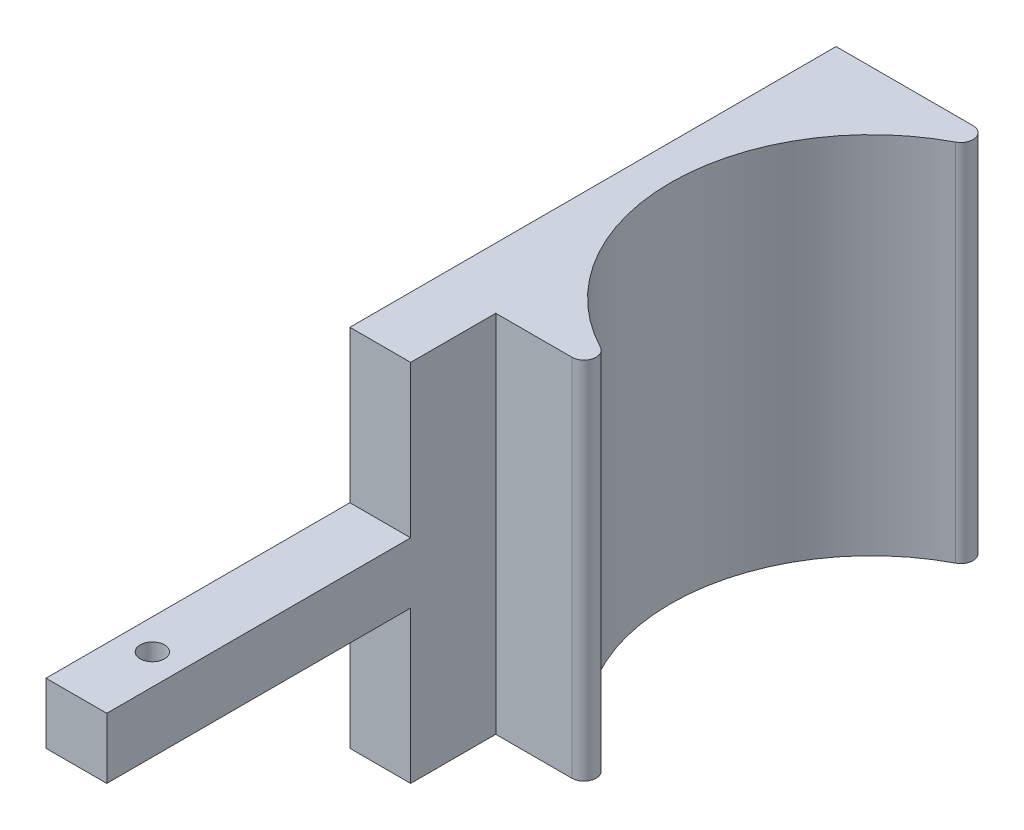
ISO-10303-21;
HEADER;
FILE_DESCRIPTION(('STEP AP214'),'2;1');
FILE_NAME('part.step','',(''),(''),'','','');
FILE_SCHEMA(('AUTOMOTIVE_DESIGN { 1 0 10303 214 1 1 1 1 }'));
ENDSEC;
DATA;
#1=APPLICATION_CONTEXT('core data for automotive mechanical design processes');
#2=APPLICATION_PROTOCOL_DEFINITION('international standard','automotive_design',2000,#1);
#3=PRODUCT_CONTEXT('',#1,'mechanical');
#4=PRODUCT('Part','Part','',(#3));
#5=PRODUCT_RELATED_PRODUCT_CATEGORY('part','',(#4));
#6=PRODUCT_DEFINITION_FORMATION('','',#4);
#7=PRODUCT_DEFINITION_CONTEXT('part definition',#1,'design');
#8=PRODUCT_DEFINITION('design','',#6,#7);
#9=PRODUCT_DEFINITION_SHAPE('','',#8);
#10=(LENGTH_UNIT() NAMED_UNIT(*) SI_UNIT(.MILLI.,.METRE.));
#11=(NAMED_UNIT(*) PLANE_ANGLE_UNIT() SI_UNIT($,.RADIAN.));
#12=(NAMED_UNIT(*) SI_UNIT($,.STERADIAN.) SOLID_ANGLE_UNIT());
#13=UNCERTAINTY_MEASURE_WITH_UNIT(LENGTH_MEASURE(1.E-05),#10,'distance_accuracy_value','');
#14=(GEOMETRIC_REPRESENTATION_CONTEXT(3) GLOBAL_UNCERTAINTY_ASSIGNED_CONTEXT((#13)) GLOBAL_UNIT_ASSIGNED_CONTEXT((#10,
#11,#12)) REPRESENTATION_CONTEXT('',''));
#15=CARTESIAN_POINT('',(0.,0.,0.));
#16=DIRECTION('',(0.,0.,1.));
#17=DIRECTION('',(1.,0.,0.));
#18=AXIS2_PLACEMENT_3D('',#15,#16,#17);
#19=CARTESIAN_POINT('',(-14.2717559119671,60.,77.9746603263434));
#20=DIRECTION('',(0.,0.,-1.));
#21=DIRECTION('',(-1.,0.,0.));
#22=AXIS2_PLACEMENT_3D('',#19,#20,#21);
#23=PLANE('',#22);
#24=DIRECTION('',(-1.,0.,0.));
#25=VECTOR('',#24,1.);
#26=CARTESIAN_POINT('',(-14.2717559119671,25.,77.9746603263434));
#27=LINE('',#26,#25);
#28=CARTESIAN_POINT('',(-4.27175591196712,25.,77.9746603263434));
#29=VERTEX_POINT('',#28);
#30=CARTESIAN_POINT('',(-14.2717559119671,25.,77.9746603263434));
#31=VERTEX_POINT('',#30);
#32=EDGE_CURVE('E148',#29,#31,#27,.T.);
#33=ORIENTED_EDGE('',*,*,#32,.F.);
#34=DIRECTION('',(0.,-1.,0.));
#35=VECTOR('',#34,1.);
#36=CARTESIAN_POINT('',(-4.27175591196712,60.,77.9746603263434));
#37=LINE('',#36,#35);
#38=CARTESIAN_POINT('',(-4.27175591196712,35.,77.9746603263434));
#39=VERTEX_POINT('',#38);
#40=EDGE_CURVE('E229',#39,#29,#37,.T.);
#41=ORIENTED_EDGE('',*,*,#40,.F.);
#42=DIRECTION('',(1.,0.,0.));
#43=VECTOR('',#42,1.);
#44=CARTESIAN_POINT('',(-14.2717559119671,35.,77.9746603263434));
#45=LINE('',#44,#43);
#46=CARTESIAN_POINT('',(-14.2717559119671,35.,77.9746603263434));
#47=VERTEX_POINT('',#46);
#48=EDGE_CURVE('E172',#47,#39,#45,.T.);
#49=ORIENTED_EDGE('',*,*,#48,.F.);
#50=DIRECTION('',(0.,-1.,0.));
#51=VECTOR('',#50,1.);
#52=CARTESIAN_POINT('',(-14.2717559119671,60.,77.9746603263434));
#53=LINE('',#52,#51);
#54=EDGE_CURVE('E233',#47,#31,#53,.T.);
#55=ORIENTED_EDGE('',*,*,#54,.T.);
#56=EDGE_LOOP('',(#33,#41,#49,#55));
#57=FACE_BOUND('',#56,.T.);
#58=ADVANCED_FACE('F38',(#57),#23,.F.);
#59=CARTESIAN_POINT('',(-14.2717559119671,60.,-52.0253396736566));
#60=DIRECTION('',(1.,0.,0.));
#61=DIRECTION('',(0.,0.,-1.));
#62=AXIS2_PLACEMENT_3D('',#59,#60,#61);
#63=PLANE('',#62);
#64=DIRECTION('',(0.,0.,1.));
#65=VECTOR('',#64,1.);
#66=CARTESIAN_POINT('',(-14.2717559119671,0.,-52.0253396736566));
#67=LINE('',#66,#65);
#68=CARTESIAN_POINT('',(-14.2717559119671,0.,-52.0253396736566));
#69=VERTEX_POINT('',#68);
#70=CARTESIAN_POINT('',(-14.2717559119671,0.,27.9746603263434));
#71=VERTEX_POINT('',#70);
#72=EDGE_CURVE('E159',#69,#71,#67,.T.);
#73=ORIENTED_EDGE('',*,*,#72,.T.);
#74=DIRECTION('',(0.,-1.,0.));
#75=VECTOR('',#74,1.);
#76=CARTESIAN_POINT('',(-14.2717559119671,25.,27.9746603263434));
#77=LINE('',#76,#75);
#78=CARTESIAN_POINT('',(-14.2717559119671,25.,27.9746603263434));
#79=VERTEX_POINT('',#78);
#80=EDGE_CURVE('E135',#79,#71,#77,.T.);
#81=ORIENTED_EDGE('',*,*,#80,.F.);
#82=DIRECTION('',(0.,0.,-1.));
#83=VECTOR('',#82,1.);
#84=CARTESIAN_POINT('',(-14.2717559119671,25.,77.9746603263434));
#85=LINE('',#84,#83);
#86=EDGE_CURVE('E143',#31,#79,#85,.T.);
#87=ORIENTED_EDGE('',*,*,#86,.F.);
#88=ORIENTED_EDGE('',*,*,#54,.F.);
#89=DIRECTION('',(0.,0.,1.));
#90=VECTOR('',#89,1.);
#91=CARTESIAN_POINT('',(-14.2717559119671,35.,77.9746603263434));
#92=LINE('',#91,#90);
#93=CARTESIAN_POINT('',(-14.2717559119671,35.,27.9746603263434));
#94=VERTEX_POINT('',#93);
#95=EDGE_CURVE('E169',#94,#47,#92,.T.);
#96=ORIENTED_EDGE('',*,*,#95,.F.);
#97=DIRECTION('',(0.,1.,0.));
#98=VECTOR('',#97,1.);
#99=CARTESIAN_POINT('',(-14.2717559119671,35.,27.9746603263434));
#100=LINE('',#99,#98);
#101=CARTESIAN_POINT('',(-14.2717559119671,60.,27.9746603263434));
#102=VERTEX_POINT('',#101);
#103=EDGE_CURVE('E185',#94,#102,#100,.T.);
#104=ORIENTED_EDGE('',*,*,#103,.T.);
#105=DIRECTION('',(0.,0.,1.));
#106=VECTOR('',#105,1.);
#107=CARTESIAN_POINT('',(-14.2717559119671,60.,-52.0253396736566));
#108=LINE('',#107,#106);
#109=CARTESIAN_POINT('',(-14.2717559119671,60.,-52.0253396736566));
#110=VERTEX_POINT('',#109);
#111=EDGE_CURVE('E191',#110,#102,#108,.T.);
#112=ORIENTED_EDGE('',*,*,#111,.F.);
#113=DIRECTION('',(0.,-1.,0.));
#114=VECTOR('',#113,1.);
#115=CARTESIAN_POINT('',(-14.2717559119671,60.,-52.0253396736566));
#116=LINE('',#115,#114);
#117=EDGE_CURVE('E208',#110,#69,#116,.T.);
#118=ORIENTED_EDGE('',*,*,#117,.T.);
#119=EDGE_LOOP('',(#73,#81,#87,#88,#96,#104,#112,#118));
#120=FACE_BOUND('',#119,.T.);
#121=ADVANCED_FACE('F156',(#120),#63,.F.);
#122=CARTESIAN_POINT('',(-4.27175591196712,60.,13.9746603263434));
#123=DIRECTION('',(-1.,0.,0.));
#124=DIRECTION('',(0.,0.,1.));
#125=AXIS2_PLACEMENT_3D('',#122,#123,#124);
#126=PLANE('',#125);
#127=DIRECTION('',(0.,0.,1.));
#128=VECTOR('',#127,1.);
#129=CARTESIAN_POINT('',(-4.27175591196712,25.,77.9746603263434));
#130=LINE('',#129,#128);
#131=CARTESIAN_POINT('',(-4.27175591196712,25.,27.9746603263434));
#132=VERTEX_POINT('',#131);
#133=EDGE_CURVE('E142',#132,#29,#130,.T.);
#134=ORIENTED_EDGE('',*,*,#133,.F.);
#135=DIRECTION('',(0.,-1.,0.));
#136=VECTOR('',#135,1.);
#137=CARTESIAN_POINT('',(-4.27175591196712,25.,27.9746603263434));
#138=LINE('',#137,#136);
#139=CARTESIAN_POINT('',(-4.27175591196712,0.,27.9746603263434));
#140=VERTEX_POINT('',#139);
#141=EDGE_CURVE('E138',#132,#140,#138,.T.);
#142=ORIENTED_EDGE('',*,*,#141,.T.);
#143=DIRECTION('',(0.,0.,-1.));
#144=VECTOR('',#143,1.);
#145=CARTESIAN_POINT('',(-4.27175591196712,0.,13.9746603263434));
#146=LINE('',#145,#144);
#147=CARTESIAN_POINT('',(-4.27175591196712,0.,13.9746603263434));
#148=VERTEX_POINT('',#147);
#149=EDGE_CURVE('E211',#140,#148,#146,.T.);
#150=ORIENTED_EDGE('',*,*,#149,.T.);
#151=DIRECTION('',(0.,-1.,0.));
#152=VECTOR('',#151,1.);
#153=CARTESIAN_POINT('',(-4.27175591196712,60.,13.9746603263434));
#154=LINE('',#153,#152);
#155=CARTESIAN_POINT('',(-4.27175591196712,60.,13.9746603263434));
#156=VERTEX_POINT('',#155);
#157=EDGE_CURVE('E225',#156,#148,#154,.T.);
#158=ORIENTED_EDGE('',*,*,#157,.F.);
#159=DIRECTION('',(0.,0.,-1.));
#160=VECTOR('',#159,1.);
#161=CARTESIAN_POINT('',(-4.27175591196712,60.,13.9746603263434));
#162=LINE('',#161,#160);
#163=CARTESIAN_POINT('',(-4.27175591196712,60.,27.9746603263434));
#164=VERTEX_POINT('',#163);
#165=EDGE_CURVE('E195',#164,#156,#162,.T.);
#166=ORIENTED_EDGE('',*,*,#165,.F.);
#167=DIRECTION('',(0.,1.,0.));
#168=VECTOR('',#167,1.);
#169=CARTESIAN_POINT('',(-4.27175591196712,35.,27.9746603263434));
#170=LINE('',#169,#168);
#171=CARTESIAN_POINT('',(-4.27175591196712,35.,27.9746603263434));
#172=VERTEX_POINT('',#171);
#173=EDGE_CURVE('E182',#172,#164,#170,.T.);
#174=ORIENTED_EDGE('',*,*,#173,.F.);
#175=DIRECTION('',(0.,0.,-1.));
#176=VECTOR('',#175,1.);
#177=CARTESIAN_POINT('',(-4.27175591196712,35.,77.9746603263434));
#178=LINE('',#177,#176);
#179=EDGE_CURVE('E175',#39,#172,#178,.T.);
#180=ORIENTED_EDGE('',*,*,#179,.F.);
#181=ORIENTED_EDGE('',*,*,#40,.T.);
#182=EDGE_LOOP('',(#134,#142,#150,#158,#166,#174,#180,#181));
#183=FACE_BOUND('',#182,.T.);
#184=ADVANCED_FACE('F272',(#183),#126,.F.);
#185=CARTESIAN_POINT('',(-4.27175591196712,60.,13.9746603263434));
#186=DIRECTION('',(0.,0.,-1.));
#187=DIRECTION('',(-1.,0.,0.));
#188=AXIS2_PLACEMENT_3D('',#185,#186,#187);
#189=PLANE('',#188);
#190=DIRECTION('',(1.,0.,0.));
#191=VECTOR('',#190,1.);
#192=CARTESIAN_POINT('',(-4.27175591196712,0.,13.9746603263434));
#193=LINE('',#192,#191);
#194=CARTESIAN_POINT('',(8.25085285795718,0.,13.9746603263434));
#195=VERTEX_POINT('',#194);
#196=EDGE_CURVE('E214',#148,#195,#193,.T.);
#197=ORIENTED_EDGE('',*,*,#196,.T.);
#198=DIRECTION('',(0.,-1.,0.));
#199=VECTOR('',#198,1.);
#200=CARTESIAN_POINT('',(8.25085285795718,60.,13.9746603263434));
#201=LINE('',#200,#199);
#202=CARTESIAN_POINT('',(8.25085285795718,60.,13.9746603263434));
#203=VERTEX_POINT('',#202);
#204=EDGE_CURVE('E63',#195,#203,#201,.F.);
#205=ORIENTED_EDGE('',*,*,#204,.T.);
#206=DIRECTION('',(1.,0.,0.));
#207=VECTOR('',#206,1.);
#208=CARTESIAN_POINT('',(-4.27175591196712,60.,13.9746603263434));
#209=LINE('',#208,#207);
#210=EDGE_CURVE('E199',#156,#203,#209,.T.);
#211=ORIENTED_EDGE('',*,*,#210,.F.);
#212=ORIENTED_EDGE('',*,*,#157,.T.);
#213=EDGE_LOOP('',(#197,#205,#211,#212));
#214=FACE_BOUND('',#213,.T.);
#215=ADVANCED_FACE('F268',(#214),#189,.F.);
#216=CARTESIAN_POINT('',(24.4989296672291,60.,-19.0253396736566));
#217=DIRECTION('',(0.,-1.,0.));
#218=DIRECTION('',(0.,0.,-1.));
#219=AXIS2_PLACEMENT_3D('',#216,#217,#218);
#220=CYLINDRICAL_SURFACE('',#219,33.);
#221=CARTESIAN_POINT('',(24.4989296672291,60.,-19.0253396736566));
#222=DIRECTION('',(0.,-1.,0.));
#223=DIRECTION('',(0.,0.,1.));
#224=AXIS2_PLACEMENT_3D('',#221,#222,#223);
#225=CIRCLE('',#224,33.);
#226=CARTESIAN_POINT('',(9.17931438991558,60.,10.2032317549148));
#227=VERTEX_POINT('',#226);
#228=CARTESIAN_POINT('',(9.17931438991555,60.,-48.253911102228));
#229=VERTEX_POINT('',#228);
#230=EDGE_CURVE('E202',#227,#229,#225,.T.);
#231=ORIENTED_EDGE('',*,*,#230,.F.);
#232=DIRECTION('',(0.,-1.,0.));
#233=VECTOR('',#232,1.);
#234=CARTESIAN_POINT('',(9.17931438991557,60.,10.2032317549148));
#235=LINE('',#234,#233);
#236=CARTESIAN_POINT('',(9.17931438991558,0.,10.2032317549148));
#237=VERTEX_POINT('',#236);
#238=EDGE_CURVE('E239',#227,#237,#235,.T.);
#239=ORIENTED_EDGE('',*,*,#238,.T.);
#240=CARTESIAN_POINT('',(24.4989296672291,0.,-19.0253396736566));
#241=DIRECTION('',(0.,-1.,0.));
#242=DIRECTION('',(0.,0.,1.));
#243=AXIS2_PLACEMENT_3D('',#240,#241,#242);
#244=CIRCLE('',#243,33.);
#245=CARTESIAN_POINT('',(9.17931438991555,0.,-48.253911102228));
#246=VERTEX_POINT('',#245);
#247=EDGE_CURVE('E217',#237,#246,#244,.T.);
#248=ORIENTED_EDGE('',*,*,#247,.T.);
#249=DIRECTION('',(0.,-1.,0.));
#250=VECTOR('',#249,1.);
#251=CARTESIAN_POINT('',(9.17931438991555,60.,-48.253911102228));
#252=LINE('',#251,#250);
#253=EDGE_CURVE('E236',#246,#229,#252,.F.);
#254=ORIENTED_EDGE('',*,*,#253,.T.);
#255=EDGE_LOOP('',(#231,#239,#248,#254));
#256=FACE_BOUND('',#255,.T.);
#257=ADVANCED_FACE('F260',(#256),#220,.F.);
#258=CARTESIAN_POINT('',(-14.2717559119671,60.,-52.0253396736566));
#259=DIRECTION('',(0.,0.,1.));
#260=DIRECTION('',(1.,0.,0.));
#261=AXIS2_PLACEMENT_3D('',#258,#259,#260);
#262=PLANE('',#261);
#263=DIRECTION('',(-1.,0.,0.));
#264=VECTOR('',#263,1.);
#265=CARTESIAN_POINT('',(-4.27175591196713,60.,-52.0253396736566));
#266=LINE('',#265,#264);
#267=CARTESIAN_POINT('',(8.25085285795715,60.,-52.0253396736566));
#268=VERTEX_POINT('',#267);
#269=EDGE_CURVE('E205',#268,#110,#266,.T.);
#270=ORIENTED_EDGE('',*,*,#269,.F.);
#271=DIRECTION('',(0.,-1.,0.));
#272=VECTOR('',#271,1.);
#273=CARTESIAN_POINT('',(8.25085285795715,60.,-52.0253396736566));
#274=LINE('',#273,#272);
#275=CARTESIAN_POINT('',(8.25085285795715,0.,-52.0253396736566));
#276=VERTEX_POINT('',#275);
#277=EDGE_CURVE('E11',#268,#276,#274,.T.);
#278=ORIENTED_EDGE('',*,*,#277,.T.);
#279=DIRECTION('',(-1.,0.,0.));
#280=VECTOR('',#279,1.);
#281=CARTESIAN_POINT('',(-14.2717559119671,0.,-52.0253396736566));
#282=LINE('',#281,#280);
#283=EDGE_CURVE('E196',#276,#69,#282,.T.);
#284=ORIENTED_EDGE('',*,*,#283,.T.);
#285=ORIENTED_EDGE('',*,*,#117,.F.);
#286=EDGE_LOOP('',(#270,#278,#284,#285));
#287=FACE_BOUND('',#286,.T.);
#288=ADVANCED_FACE('F305',(#287),#262,.F.);
#289=CARTESIAN_POINT('',(24.4989296672291,60.,-19.0253396736566));
#290=DIRECTION('',(0.,1.,0.));
#291=DIRECTION('',(0.,0.,1.));
#292=AXIS2_PLACEMENT_3D('',#289,#290,#291);
#293=PLANE('',#292);
#294=ORIENTED_EDGE('',*,*,#210,.T.);
#295=CARTESIAN_POINT('',(8.25085285795718,60.,11.9746603263434));
#296=DIRECTION('',(0.,1.,0.));
#297=DIRECTION('',(0.,0.,1.));
#298=AXIS2_PLACEMENT_3D('',#295,#296,#297);
#299=CIRCLE('',#298,2.);
#300=EDGE_CURVE('E48',#203,#227,#299,.T.);
#301=ORIENTED_EDGE('',*,*,#300,.T.);
#302=ORIENTED_EDGE('',*,*,#230,.T.);
#303=CARTESIAN_POINT('',(8.25085285795715,60.,-50.0253396736566));
#304=DIRECTION('',(0.,1.,0.));
#305=DIRECTION('',(0.,0.,1.));
#306=AXIS2_PLACEMENT_3D('',#303,#304,#305);
#307=CIRCLE('',#306,2.);
#308=EDGE_CURVE('E55',#229,#268,#307,.T.);
#309=ORIENTED_EDGE('',*,*,#308,.T.);
#310=ORIENTED_EDGE('',*,*,#269,.T.);
#311=ORIENTED_EDGE('',*,*,#111,.T.);
#312=DIRECTION('',(-1.,0.,0.));
#313=VECTOR('',#312,1.);
#314=CARTESIAN_POINT('',(-14.2717559119671,60.,27.9746603263434));
#315=LINE('',#314,#313);
#316=EDGE_CURVE('E164',#164,#102,#315,.T.);
#317=ORIENTED_EDGE('',*,*,#316,.F.);
#318=ORIENTED_EDGE('',*,*,#165,.T.);
#319=EDGE_LOOP('',(#294,#301,#302,#309,#310,#311,#317,#318));
#320=FACE_BOUND('',#319,.T.);
#321=ADVANCED_FACE('F256',(#320),#293,.T.);
#322=CARTESIAN_POINT('',(24.4989296672291,0.,-19.0253396736566));
#323=DIRECTION('',(0.,1.,0.));
#324=DIRECTION('',(0.,0.,1.));
#325=AXIS2_PLACEMENT_3D('',#322,#323,#324);
#326=PLANE('',#325);
#327=ORIENTED_EDGE('',*,*,#247,.F.);
#328=CARTESIAN_POINT('',(8.25085285795718,0.,11.9746603263434));
#329=DIRECTION('',(0.,1.,0.));
#330=DIRECTION('',(0.,0.,1.));
#331=AXIS2_PLACEMENT_3D('',#328,#329,#330);
#332=CIRCLE('',#331,2.);
#333=EDGE_CURVE('E246',#237,#195,#332,.F.);
#334=ORIENTED_EDGE('',*,*,#333,.T.);
#335=ORIENTED_EDGE('',*,*,#196,.F.);
#336=ORIENTED_EDGE('',*,*,#149,.F.);
#337=DIRECTION('',(1.,0.,0.));
#338=VECTOR('',#337,1.);
#339=CARTESIAN_POINT('',(-14.2717559119671,0.,27.9746603263434));
#340=LINE('',#339,#338);
#341=EDGE_CURVE('E153',#71,#140,#340,.T.);
#342=ORIENTED_EDGE('',*,*,#341,.F.);
#343=ORIENTED_EDGE('',*,*,#72,.F.);
#344=ORIENTED_EDGE('',*,*,#283,.F.);
#345=CARTESIAN_POINT('',(8.25085285795715,0.,-50.0253396736566));
#346=DIRECTION('',(0.,1.,0.));
#347=DIRECTION('',(0.,0.,1.));
#348=AXIS2_PLACEMENT_3D('',#345,#346,#347);
#349=CIRCLE('',#348,2.);
#350=EDGE_CURVE('E243',#276,#246,#349,.F.);
#351=ORIENTED_EDGE('',*,*,#350,.T.);
#352=EDGE_LOOP('',(#327,#334,#335,#336,#342,#343,#344,#351));
#353=FACE_BOUND('',#352,.T.);
#354=ADVANCED_FACE('F266',(#353),#326,.F.);
#355=CARTESIAN_POINT('',(-14.2717559119671,35.,27.9746603263434));
#356=DIRECTION('',(0.,0.,-1.));
#357=DIRECTION('',(-1.,0.,0.));
#358=AXIS2_PLACEMENT_3D('',#355,#356,#357);
#359=PLANE('',#358);
#360=ORIENTED_EDGE('',*,*,#316,.T.);
#361=ORIENTED_EDGE('',*,*,#103,.F.);
#362=DIRECTION('',(-1.,0.,0.));
#363=VECTOR('',#362,1.);
#364=CARTESIAN_POINT('',(-14.2717559119671,35.,27.9746603263434));
#365=LINE('',#364,#363);
#366=EDGE_CURVE('E178',#172,#94,#365,.T.);
#367=ORIENTED_EDGE('',*,*,#366,.F.);
#368=ORIENTED_EDGE('',*,*,#173,.T.);
#369=EDGE_LOOP('',(#360,#361,#367,#368));
#370=FACE_BOUND('',#369,.T.);
#371=ADVANCED_FACE('F291',(#370),#359,.F.);
#372=CARTESIAN_POINT('',(0.,35.,0.));
#373=DIRECTION('',(0.,-1.,0.));
#374=DIRECTION('',(0.,0.,-1.));
#375=AXIS2_PLACEMENT_3D('',#372,#373,#374);
#376=PLANE('',#375);
#377=CARTESIAN_POINT('',(-9.27175591196712,35.,65.4746603263434));
#378=DIRECTION('',(0.,1.,0.));
#379=DIRECTION('',(0.,0.,1.));
#380=AXIS2_PLACEMENT_3D('',#377,#378,#379);
#381=CIRCLE('',#380,2.);
#382=CARTESIAN_POINT('',(-9.27175591196712,35.,67.4746603263434));
#383=VERTEX_POINT('',#382);
#384=EDGE_CURVE('E278',#383,#383,#381,.T.);
#385=ORIENTED_EDGE('',*,*,#384,.F.);
#386=EDGE_LOOP('',(#385));
#387=FACE_BOUND('',#386,.T.);
#388=ORIENTED_EDGE('',*,*,#95,.T.);
#389=ORIENTED_EDGE('',*,*,#48,.T.);
#390=ORIENTED_EDGE('',*,*,#179,.T.);
#391=ORIENTED_EDGE('',*,*,#366,.T.);
#392=EDGE_LOOP('',(#388,#389,#390,#391));
#393=FACE_BOUND('',#392,.T.);
#394=ADVANCED_FACE('F288',(#387,#393),#376,.F.);
#395=CARTESIAN_POINT('',(-14.2717559119671,25.,27.9746603263434));
#396=DIRECTION('',(0.,0.,-1.));
#397=DIRECTION('',(-1.,0.,0.));
#398=AXIS2_PLACEMENT_3D('',#395,#396,#397);
#399=PLANE('',#398);
#400=ORIENTED_EDGE('',*,*,#341,.T.);
#401=ORIENTED_EDGE('',*,*,#141,.F.);
#402=DIRECTION('',(1.,0.,0.));
#403=VECTOR('',#402,1.);
#404=CARTESIAN_POINT('',(-14.2717559119671,25.,27.9746603263434));
#405=LINE('',#404,#403);
#406=EDGE_CURVE('E131',#79,#132,#405,.T.);
#407=ORIENTED_EDGE('',*,*,#406,.F.);
#408=ORIENTED_EDGE('',*,*,#80,.T.);
#409=EDGE_LOOP('',(#400,#401,#407,#408));
#410=FACE_BOUND('',#409,.T.);
#411=ADVANCED_FACE('F133',(#410),#399,.F.);
#412=CARTESIAN_POINT('',(0.,25.,0.));
#413=DIRECTION('',(0.,-1.,0.));
#414=DIRECTION('',(0.,0.,-1.));
#415=AXIS2_PLACEMENT_3D('',#412,#413,#414);
#416=PLANE('',#415);
#417=CARTESIAN_POINT('',(-9.27175591196712,25.,65.4746603263434));
#418=DIRECTION('',(0.,-1.,0.));
#419=DIRECTION('',(0.,0.,-1.));
#420=AXIS2_PLACEMENT_3D('',#417,#418,#419);
#421=CIRCLE('',#420,2.);
#422=CARTESIAN_POINT('',(-9.27175591196712,25.,63.4746603263434));
#423=VERTEX_POINT('',#422);
#424=EDGE_CURVE('E42',#423,#423,#421,.T.);
#425=ORIENTED_EDGE('',*,*,#424,.F.);
#426=EDGE_LOOP('',(#425));
#427=FACE_BOUND('',#426,.T.);
#428=ORIENTED_EDGE('',*,*,#86,.T.);
#429=ORIENTED_EDGE('',*,*,#406,.T.);
#430=ORIENTED_EDGE('',*,*,#133,.T.);
#431=ORIENTED_EDGE('',*,*,#32,.T.);
#432=EDGE_LOOP('',(#428,#429,#430,#431));
#433=FACE_BOUND('',#432,.T.);
#434=ADVANCED_FACE('F146',(#427,#433),#416,.T.);
#435=CARTESIAN_POINT('',(8.25085285795718,60.,11.9746603263434));
#436=DIRECTION('',(0.,-1.,0.));
#437=DIRECTION('',(0.,0.,-1.));
#438=AXIS2_PLACEMENT_3D('',#435,#436,#437);
#439=CYLINDRICAL_SURFACE('',#438,2.);
#440=ORIENTED_EDGE('',*,*,#300,.F.);
#441=ORIENTED_EDGE('',*,*,#204,.F.);
#442=ORIENTED_EDGE('',*,*,#333,.F.);
#443=ORIENTED_EDGE('',*,*,#238,.F.);
#444=EDGE_LOOP('',(#440,#441,#442,#443));
#445=FACE_BOUND('',#444,.T.);
#446=ADVANCED_FACE('F263',(#445),#439,.T.);
#447=CARTESIAN_POINT('',(8.25085285795715,60.,-50.0253396736566));
#448=DIRECTION('',(0.,-1.,0.));
#449=DIRECTION('',(0.,0.,-1.));
#450=AXIS2_PLACEMENT_3D('',#447,#448,#449);
#451=CYLINDRICAL_SURFACE('',#450,2.);
#452=ORIENTED_EDGE('',*,*,#308,.F.);
#453=ORIENTED_EDGE('',*,*,#253,.F.);
#454=ORIENTED_EDGE('',*,*,#350,.F.);
#455=ORIENTED_EDGE('',*,*,#277,.F.);
#456=EDGE_LOOP('',(#452,#453,#454,#455));
#457=FACE_BOUND('',#456,.T.);
#458=ADVANCED_FACE('F40',(#457),#451,.T.);
#459=CARTESIAN_POINT('',(-9.27175591196712,9.99999999999999,65.4746603263434));
#460=DIRECTION('',(0.,1.,0.));
#461=DIRECTION('',(0.,0.,1.));
#462=AXIS2_PLACEMENT_3D('',#459,#460,#461);
#463=CYLINDRICAL_SURFACE('',#462,2.);
#464=ORIENTED_EDGE('',*,*,#424,.T.);
#465=EDGE_LOOP('',(#464));
#466=FACE_BOUND('',#465,.T.);
#467=ORIENTED_EDGE('',*,*,#384,.T.);
#468=EDGE_LOOP('',(#467));
#469=FACE_BOUND('',#468,.T.);
#470=ADVANCED_FACE('F286',(#466,#469),#463,.F.);
#471=CLOSED_SHELL('',(#58,#121,#184,#215,#257,#288,#321,#354,#371,#394,#411,#434,#446,#458,#470));
#472=MANIFOLD_SOLID_BREP('B2',#471);
#473=ADVANCED_BREP_SHAPE_REPRESENTATION('',(#18,#472),#14);
#474=SHAPE_DEFINITION_REPRESENTATION(#9,#473);
ENDSEC;
END-ISO-10303-21;
